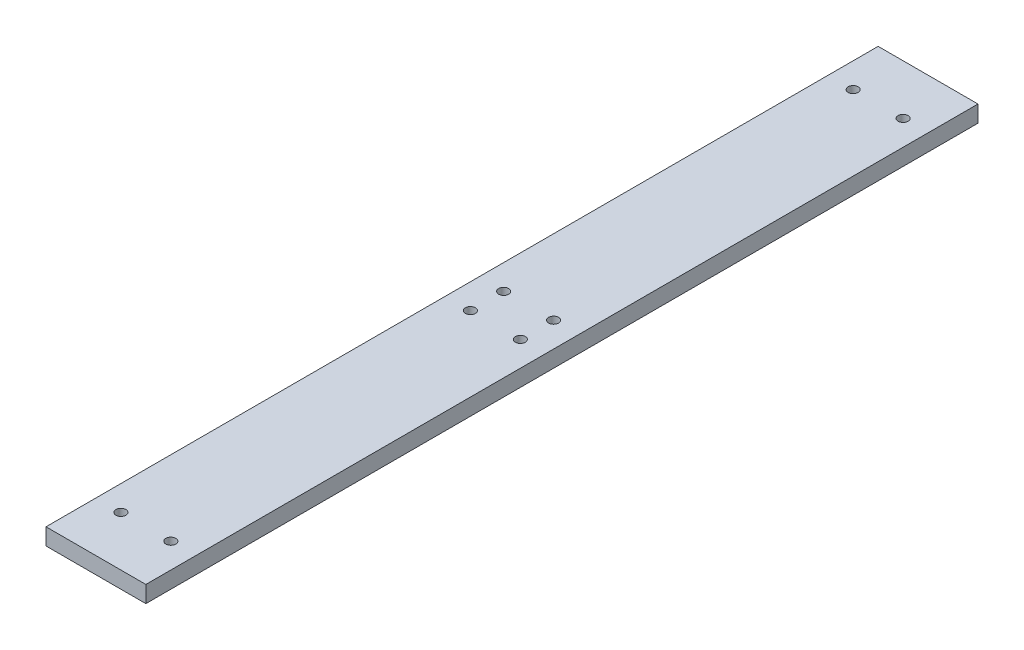
ISO-10303-21;
HEADER;
FILE_DESCRIPTION(('STEP AP214'),'2;1');
FILE_NAME('part.step','',(''),(''),'','','');
FILE_SCHEMA(('AUTOMOTIVE_DESIGN { 1 0 10303 214 1 1 1 1 }'));
ENDSEC;
DATA;
#1=APPLICATION_CONTEXT('core data for automotive mechanical design processes');
#2=APPLICATION_PROTOCOL_DEFINITION('international standard','automotive_design',2000,#1);
#3=PRODUCT_CONTEXT('',#1,'mechanical');
#4=PRODUCT('Part','Part','',(#3));
#5=PRODUCT_RELATED_PRODUCT_CATEGORY('part','',(#4));
#6=PRODUCT_DEFINITION_FORMATION('','',#4);
#7=PRODUCT_DEFINITION_CONTEXT('part definition',#1,'design');
#8=PRODUCT_DEFINITION('design','',#6,#7);
#9=PRODUCT_DEFINITION_SHAPE('','',#8);
#10=(LENGTH_UNIT() NAMED_UNIT(*) SI_UNIT(.MILLI.,.METRE.));
#11=(NAMED_UNIT(*) PLANE_ANGLE_UNIT() SI_UNIT($,.RADIAN.));
#12=(NAMED_UNIT(*) SI_UNIT($,.STERADIAN.) SOLID_ANGLE_UNIT());
#13=UNCERTAINTY_MEASURE_WITH_UNIT(LENGTH_MEASURE(1.E-05),#10,'distance_accuracy_value','');
#14=(GEOMETRIC_REPRESENTATION_CONTEXT(3) GLOBAL_UNCERTAINTY_ASSIGNED_CONTEXT((#13)) GLOBAL_UNIT_ASSIGNED_CONTEXT((#10,
#11,#12)) REPRESENTATION_CONTEXT('',''));
#15=CARTESIAN_POINT('',(0.,0.,0.));
#16=DIRECTION('',(0.,0.,1.));
#17=DIRECTION('',(1.,0.,0.));
#18=AXIS2_PLACEMENT_3D('',#15,#16,#17);
#19=CARTESIAN_POINT('',(0.,20.,0.));
#20=DIRECTION('',(0.,-1.,0.));
#21=DIRECTION('',(0.,0.,-1.));
#22=AXIS2_PLACEMENT_3D('',#19,#20,#21);
#23=PLANE('',#22);
#24=DIRECTION('',(0.,0.,1.));
#25=VECTOR('',#24,1.);
#26=CARTESIAN_POINT('',(0.,20.,0.));
#27=LINE('',#26,#25);
#28=CARTESIAN_POINT('',(0.,20.,-1000.));
#29=VERTEX_POINT('',#28);
#30=CARTESIAN_POINT('',(0.,20.,0.));
#31=VERTEX_POINT('',#30);
#32=EDGE_CURVE('E86',#29,#31,#27,.T.);
#33=ORIENTED_EDGE('',*,*,#32,.T.);
#34=DIRECTION('',(1.,0.,0.));
#35=VECTOR('',#34,1.);
#36=CARTESIAN_POINT('',(0.,20.,0.));
#37=LINE('',#36,#35);
#38=CARTESIAN_POINT('',(120.,20.,0.));
#39=VERTEX_POINT('',#38);
#40=EDGE_CURVE('E81',#31,#39,#37,.T.);
#41=ORIENTED_EDGE('',*,*,#40,.T.);
#42=DIRECTION('',(0.,0.,-1.));
#43=VECTOR('',#42,1.);
#44=CARTESIAN_POINT('',(120.,20.,0.));
#45=LINE('',#44,#43);
#46=CARTESIAN_POINT('',(120.,20.,-1000.));
#47=VERTEX_POINT('',#46);
#48=EDGE_CURVE('E84',#39,#47,#45,.T.);
#49=ORIENTED_EDGE('',*,*,#48,.T.);
#50=DIRECTION('',(-1.,0.,0.));
#51=VECTOR('',#50,1.);
#52=CARTESIAN_POINT('',(0.,20.,-1000.));
#53=LINE('',#52,#51);
#54=EDGE_CURVE('E51',#47,#29,#53,.T.);
#55=ORIENTED_EDGE('',*,*,#54,.T.);
#56=EDGE_LOOP('',(#33,#41,#49,#55));
#57=FACE_BOUND('',#56,.T.);
#58=CARTESIAN_POINT('',(30.,20.,-60.));
#59=DIRECTION('',(0.,1.,0.));
#60=DIRECTION('',(0.,0.,1.));
#61=AXIS2_PLACEMENT_3D('',#58,#59,#60);
#62=CIRCLE('',#61,5.99999999999999);
#63=CARTESIAN_POINT('',(30.,20.,-54.));
#64=VERTEX_POINT('',#63);
#65=EDGE_CURVE('E101',#64,#64,#62,.T.);
#66=ORIENTED_EDGE('',*,*,#65,.F.);
#67=EDGE_LOOP('',(#66));
#68=FACE_BOUND('',#67,.T.);
#69=CARTESIAN_POINT('',(90.,20.,-60.));
#70=DIRECTION('',(0.,1.,0.));
#71=DIRECTION('',(0.,0.,-1.));
#72=AXIS2_PLACEMENT_3D('',#69,#70,#71);
#73=CIRCLE('',#72,5.99999999999999);
#74=CARTESIAN_POINT('',(90.,20.,-66.));
#75=VERTEX_POINT('',#74);
#76=EDGE_CURVE('E116',#75,#75,#73,.T.);
#77=ORIENTED_EDGE('',*,*,#76,.F.);
#78=EDGE_LOOP('',(#77));
#79=FACE_BOUND('',#78,.T.);
#80=CARTESIAN_POINT('',(90.,20.,-480.));
#81=DIRECTION('',(0.,1.,0.));
#82=DIRECTION('',(0.,0.,1.));
#83=AXIS2_PLACEMENT_3D('',#80,#81,#82);
#84=CIRCLE('',#83,5.99999999999999);
#85=CARTESIAN_POINT('',(90.,20.,-474.));
#86=VERTEX_POINT('',#85);
#87=EDGE_CURVE('E122',#86,#86,#84,.T.);
#88=ORIENTED_EDGE('',*,*,#87,.F.);
#89=EDGE_LOOP('',(#88));
#90=FACE_BOUND('',#89,.T.);
#91=CARTESIAN_POINT('',(30.,20.,-480.));
#92=DIRECTION('',(0.,1.,0.));
#93=DIRECTION('',(0.,0.,-1.));
#94=AXIS2_PLACEMENT_3D('',#91,#92,#93);
#95=CIRCLE('',#94,6.00000000000001);
#96=CARTESIAN_POINT('',(30.,20.,-486.));
#97=VERTEX_POINT('',#96);
#98=EDGE_CURVE('E128',#97,#97,#95,.T.);
#99=ORIENTED_EDGE('',*,*,#98,.F.);
#100=EDGE_LOOP('',(#99));
#101=FACE_BOUND('',#100,.T.);
#102=CARTESIAN_POINT('',(90.,20.,-520.));
#103=DIRECTION('',(0.,1.,0.));
#104=DIRECTION('',(0.,0.,-1.));
#105=AXIS2_PLACEMENT_3D('',#102,#103,#104);
#106=CIRCLE('',#105,5.99999999999999);
#107=CARTESIAN_POINT('',(90.,20.,-526.));
#108=VERTEX_POINT('',#107);
#109=EDGE_CURVE('E134',#108,#108,#106,.T.);
#110=ORIENTED_EDGE('',*,*,#109,.F.);
#111=EDGE_LOOP('',(#110));
#112=FACE_BOUND('',#111,.T.);
#113=CARTESIAN_POINT('',(90.,20.,-940.));
#114=DIRECTION('',(0.,1.,0.));
#115=DIRECTION('',(0.,0.,1.));
#116=AXIS2_PLACEMENT_3D('',#113,#114,#115);
#117=CIRCLE('',#116,5.99999999999999);
#118=CARTESIAN_POINT('',(90.,20.,-934.));
#119=VERTEX_POINT('',#118);
#120=EDGE_CURVE('E140',#119,#119,#117,.T.);
#121=ORIENTED_EDGE('',*,*,#120,.F.);
#122=EDGE_LOOP('',(#121));
#123=FACE_BOUND('',#122,.T.);
#124=CARTESIAN_POINT('',(30.,20.,-940.));
#125=DIRECTION('',(0.,1.,0.));
#126=DIRECTION('',(0.,0.,-1.));
#127=AXIS2_PLACEMENT_3D('',#124,#125,#126);
#128=CIRCLE('',#127,6.);
#129=CARTESIAN_POINT('',(30.,20.,-946.));
#130=VERTEX_POINT('',#129);
#131=EDGE_CURVE('E146',#130,#130,#128,.T.);
#132=ORIENTED_EDGE('',*,*,#131,.F.);
#133=EDGE_LOOP('',(#132));
#134=FACE_BOUND('',#133,.T.);
#135=CARTESIAN_POINT('',(30.,20.,-520.));
#136=DIRECTION('',(0.,1.,0.));
#137=DIRECTION('',(0.,0.,1.));
#138=AXIS2_PLACEMENT_3D('',#135,#136,#137);
#139=CIRCLE('',#138,6.00000000000001);
#140=CARTESIAN_POINT('',(30.,20.,-514.));
#141=VERTEX_POINT('',#140);
#142=EDGE_CURVE('E152',#141,#141,#139,.T.);
#143=ORIENTED_EDGE('',*,*,#142,.F.);
#144=EDGE_LOOP('',(#143));
#145=FACE_BOUND('',#144,.T.);
#146=ADVANCED_FACE('F34',(#57,#68,#79,#90,#101,#112,#123,#134,#145),#23,.F.);
#147=CARTESIAN_POINT('',(0.,0.,0.));
#148=DIRECTION('',(0.,-1.,0.));
#149=DIRECTION('',(0.,0.,-1.));
#150=AXIS2_PLACEMENT_3D('',#147,#148,#149);
#151=PLANE('',#150);
#152=CARTESIAN_POINT('',(30.,0.,-940.));
#153=DIRECTION('',(0.,1.,0.));
#154=DIRECTION('',(0.,0.,-1.));
#155=AXIS2_PLACEMENT_3D('',#152,#153,#154);
#156=CIRCLE('',#155,6.);
#157=CARTESIAN_POINT('',(30.,0.,-946.));
#158=VERTEX_POINT('',#157);
#159=EDGE_CURVE('E149',#158,#158,#156,.T.);
#160=ORIENTED_EDGE('',*,*,#159,.T.);
#161=EDGE_LOOP('',(#160));
#162=FACE_BOUND('',#161,.T.);
#163=CARTESIAN_POINT('',(90.,0.,-520.));
#164=DIRECTION('',(0.,1.,0.));
#165=DIRECTION('',(0.,0.,-1.));
#166=AXIS2_PLACEMENT_3D('',#163,#164,#165);
#167=CIRCLE('',#166,5.99999999999999);
#168=CARTESIAN_POINT('',(90.,0.,-526.));
#169=VERTEX_POINT('',#168);
#170=EDGE_CURVE('E137',#169,#169,#167,.T.);
#171=ORIENTED_EDGE('',*,*,#170,.T.);
#172=EDGE_LOOP('',(#171));
#173=FACE_BOUND('',#172,.T.);
#174=CARTESIAN_POINT('',(90.,0.,-480.));
#175=DIRECTION('',(0.,1.,0.));
#176=DIRECTION('',(0.,0.,1.));
#177=AXIS2_PLACEMENT_3D('',#174,#175,#176);
#178=CIRCLE('',#177,5.99999999999999);
#179=CARTESIAN_POINT('',(90.,0.,-474.));
#180=VERTEX_POINT('',#179);
#181=EDGE_CURVE('E125',#180,#180,#178,.T.);
#182=ORIENTED_EDGE('',*,*,#181,.T.);
#183=EDGE_LOOP('',(#182));
#184=FACE_BOUND('',#183,.T.);
#185=CARTESIAN_POINT('',(30.,0.,-60.));
#186=DIRECTION('',(0.,1.,0.));
#187=DIRECTION('',(0.,0.,1.));
#188=AXIS2_PLACEMENT_3D('',#185,#186,#187);
#189=CIRCLE('',#188,5.99999999999999);
#190=CARTESIAN_POINT('',(30.,0.,-54.));
#191=VERTEX_POINT('',#190);
#192=EDGE_CURVE('E113',#191,#191,#189,.T.);
#193=ORIENTED_EDGE('',*,*,#192,.T.);
#194=EDGE_LOOP('',(#193));
#195=FACE_BOUND('',#194,.T.);
#196=DIRECTION('',(0.,0.,1.));
#197=VECTOR('',#196,1.);
#198=CARTESIAN_POINT('',(0.,0.,0.));
#199=LINE('',#198,#197);
#200=CARTESIAN_POINT('',(0.,0.,-1000.));
#201=VERTEX_POINT('',#200);
#202=CARTESIAN_POINT('',(0.,0.,0.));
#203=VERTEX_POINT('',#202);
#204=EDGE_CURVE('E98',#201,#203,#199,.T.);
#205=ORIENTED_EDGE('',*,*,#204,.F.);
#206=DIRECTION('',(-1.,0.,0.));
#207=VECTOR('',#206,1.);
#208=CARTESIAN_POINT('',(0.,0.,-1000.));
#209=LINE('',#208,#207);
#210=CARTESIAN_POINT('',(120.,0.,-1000.));
#211=VERTEX_POINT('',#210);
#212=EDGE_CURVE('E74',#211,#201,#209,.T.);
#213=ORIENTED_EDGE('',*,*,#212,.F.);
#214=DIRECTION('',(0.,0.,-1.));
#215=VECTOR('',#214,1.);
#216=CARTESIAN_POINT('',(120.,0.,0.));
#217=LINE('',#216,#215);
#218=CARTESIAN_POINT('',(120.,0.,0.));
#219=VERTEX_POINT('',#218);
#220=EDGE_CURVE('E68',#219,#211,#217,.T.);
#221=ORIENTED_EDGE('',*,*,#220,.F.);
#222=DIRECTION('',(1.,0.,0.));
#223=VECTOR('',#222,1.);
#224=CARTESIAN_POINT('',(0.,0.,0.));
#225=LINE('',#224,#223);
#226=EDGE_CURVE('E90',#203,#219,#225,.T.);
#227=ORIENTED_EDGE('',*,*,#226,.F.);
#228=EDGE_LOOP('',(#205,#213,#221,#227));
#229=FACE_BOUND('',#228,.T.);
#230=CARTESIAN_POINT('',(90.,0.,-60.));
#231=DIRECTION('',(0.,1.,0.));
#232=DIRECTION('',(0.,0.,-1.));
#233=AXIS2_PLACEMENT_3D('',#230,#231,#232);
#234=CIRCLE('',#233,5.99999999999999);
#235=CARTESIAN_POINT('',(90.,0.,-66.));
#236=VERTEX_POINT('',#235);
#237=EDGE_CURVE('E119',#236,#236,#234,.T.);
#238=ORIENTED_EDGE('',*,*,#237,.T.);
#239=EDGE_LOOP('',(#238));
#240=FACE_BOUND('',#239,.T.);
#241=CARTESIAN_POINT('',(30.,0.,-480.));
#242=DIRECTION('',(0.,1.,0.));
#243=DIRECTION('',(0.,0.,-1.));
#244=AXIS2_PLACEMENT_3D('',#241,#242,#243);
#245=CIRCLE('',#244,6.00000000000001);
#246=CARTESIAN_POINT('',(30.,0.,-486.));
#247=VERTEX_POINT('',#246);
#248=EDGE_CURVE('E131',#247,#247,#245,.T.);
#249=ORIENTED_EDGE('',*,*,#248,.T.);
#250=EDGE_LOOP('',(#249));
#251=FACE_BOUND('',#250,.T.);
#252=CARTESIAN_POINT('',(90.,0.,-940.));
#253=DIRECTION('',(0.,1.,0.));
#254=DIRECTION('',(0.,0.,1.));
#255=AXIS2_PLACEMENT_3D('',#252,#253,#254);
#256=CIRCLE('',#255,5.99999999999999);
#257=CARTESIAN_POINT('',(90.,0.,-934.));
#258=VERTEX_POINT('',#257);
#259=EDGE_CURVE('E143',#258,#258,#256,.T.);
#260=ORIENTED_EDGE('',*,*,#259,.T.);
#261=EDGE_LOOP('',(#260));
#262=FACE_BOUND('',#261,.T.);
#263=CARTESIAN_POINT('',(30.,0.,-520.));
#264=DIRECTION('',(0.,1.,0.));
#265=DIRECTION('',(0.,0.,1.));
#266=AXIS2_PLACEMENT_3D('',#263,#264,#265);
#267=CIRCLE('',#266,6.00000000000001);
#268=CARTESIAN_POINT('',(30.,0.,-514.));
#269=VERTEX_POINT('',#268);
#270=EDGE_CURVE('E155',#269,#269,#267,.T.);
#271=ORIENTED_EDGE('',*,*,#270,.T.);
#272=EDGE_LOOP('',(#271));
#273=FACE_BOUND('',#272,.T.);
#274=ADVANCED_FACE('F109',(#162,#173,#184,#195,#229,#240,#251,#262,#273),#151,.T.);
#275=CARTESIAN_POINT('',(0.,20.,0.));
#276=DIRECTION('',(1.,0.,0.));
#277=DIRECTION('',(0.,0.,-1.));
#278=AXIS2_PLACEMENT_3D('',#275,#276,#277);
#279=PLANE('',#278);
#280=ORIENTED_EDGE('',*,*,#204,.T.);
#281=DIRECTION('',(0.,-1.,0.));
#282=VECTOR('',#281,1.);
#283=CARTESIAN_POINT('',(0.,20.,0.));
#284=LINE('',#283,#282);
#285=EDGE_CURVE('E11',#31,#203,#284,.T.);
#286=ORIENTED_EDGE('',*,*,#285,.F.);
#287=ORIENTED_EDGE('',*,*,#32,.F.);
#288=DIRECTION('',(0.,-1.,0.));
#289=VECTOR('',#288,1.);
#290=CARTESIAN_POINT('',(0.,20.,-1000.));
#291=LINE('',#290,#289);
#292=EDGE_CURVE('E94',#29,#201,#291,.T.);
#293=ORIENTED_EDGE('',*,*,#292,.T.);
#294=EDGE_LOOP('',(#280,#286,#287,#293));
#295=FACE_BOUND('',#294,.T.);
#296=ADVANCED_FACE('F36',(#295),#279,.F.);
#297=CARTESIAN_POINT('',(0.,20.,0.));
#298=DIRECTION('',(0.,0.,-1.));
#299=DIRECTION('',(-1.,0.,0.));
#300=AXIS2_PLACEMENT_3D('',#297,#298,#299);
#301=PLANE('',#300);
#302=ORIENTED_EDGE('',*,*,#226,.T.);
#303=DIRECTION('',(0.,-1.,0.));
#304=VECTOR('',#303,1.);
#305=CARTESIAN_POINT('',(120.,20.,0.));
#306=LINE('',#305,#304);
#307=EDGE_CURVE('E43',#39,#219,#306,.T.);
#308=ORIENTED_EDGE('',*,*,#307,.F.);
#309=ORIENTED_EDGE('',*,*,#40,.F.);
#310=ORIENTED_EDGE('',*,*,#285,.T.);
#311=EDGE_LOOP('',(#302,#308,#309,#310));
#312=FACE_BOUND('',#311,.T.);
#313=ADVANCED_FACE('F89',(#312),#301,.F.);
#314=CARTESIAN_POINT('',(120.,20.,0.));
#315=DIRECTION('',(-1.,0.,0.));
#316=DIRECTION('',(0.,0.,1.));
#317=AXIS2_PLACEMENT_3D('',#314,#315,#316);
#318=PLANE('',#317);
#319=ORIENTED_EDGE('',*,*,#220,.T.);
#320=DIRECTION('',(0.,-1.,0.));
#321=VECTOR('',#320,1.);
#322=CARTESIAN_POINT('',(120.,20.,-1000.));
#323=LINE('',#322,#321);
#324=EDGE_CURVE('E91',#47,#211,#323,.T.);
#325=ORIENTED_EDGE('',*,*,#324,.F.);
#326=ORIENTED_EDGE('',*,*,#48,.F.);
#327=ORIENTED_EDGE('',*,*,#307,.T.);
#328=EDGE_LOOP('',(#319,#325,#326,#327));
#329=FACE_BOUND('',#328,.T.);
#330=ADVANCED_FACE('F92',(#329),#318,.F.);
#331=CARTESIAN_POINT('',(0.,20.,-1000.));
#332=DIRECTION('',(0.,0.,1.));
#333=DIRECTION('',(1.,0.,0.));
#334=AXIS2_PLACEMENT_3D('',#331,#332,#333);
#335=PLANE('',#334);
#336=ORIENTED_EDGE('',*,*,#212,.T.);
#337=ORIENTED_EDGE('',*,*,#292,.F.);
#338=ORIENTED_EDGE('',*,*,#54,.F.);
#339=ORIENTED_EDGE('',*,*,#324,.T.);
#340=EDGE_LOOP('',(#336,#337,#338,#339));
#341=FACE_BOUND('',#340,.T.);
#342=ADVANCED_FACE('F106',(#341),#335,.F.);
#343=CARTESIAN_POINT('',(30.,20.,-60.));
#344=DIRECTION('',(0.,-1.,0.));
#345=DIRECTION('',(0.,0.,-1.));
#346=AXIS2_PLACEMENT_3D('',#343,#344,#345);
#347=CYLINDRICAL_SURFACE('',#346,5.99999999999999);
#348=ORIENTED_EDGE('',*,*,#65,.T.);
#349=EDGE_LOOP('',(#348));
#350=FACE_BOUND('',#349,.T.);
#351=ORIENTED_EDGE('',*,*,#192,.F.);
#352=EDGE_LOOP('',(#351));
#353=FACE_BOUND('',#352,.T.);
#354=ADVANCED_FACE('F172',(#350,#353),#347,.F.);
#355=CARTESIAN_POINT('',(90.,20.,-60.));
#356=DIRECTION('',(0.,-1.,0.));
#357=DIRECTION('',(0.,0.,-1.));
#358=AXIS2_PLACEMENT_3D('',#355,#356,#357);
#359=CYLINDRICAL_SURFACE('',#358,5.99999999999999);
#360=ORIENTED_EDGE('',*,*,#76,.T.);
#361=EDGE_LOOP('',(#360));
#362=FACE_BOUND('',#361,.T.);
#363=ORIENTED_EDGE('',*,*,#237,.F.);
#364=EDGE_LOOP('',(#363));
#365=FACE_BOUND('',#364,.T.);
#366=ADVANCED_FACE('F218',(#362,#365),#359,.F.);
#367=CARTESIAN_POINT('',(90.,20.,-480.));
#368=DIRECTION('',(0.,-1.,0.));
#369=DIRECTION('',(0.,0.,-1.));
#370=AXIS2_PLACEMENT_3D('',#367,#368,#369);
#371=CYLINDRICAL_SURFACE('',#370,5.99999999999999);
#372=ORIENTED_EDGE('',*,*,#87,.T.);
#373=EDGE_LOOP('',(#372));
#374=FACE_BOUND('',#373,.T.);
#375=ORIENTED_EDGE('',*,*,#181,.F.);
#376=EDGE_LOOP('',(#375));
#377=FACE_BOUND('',#376,.T.);
#378=ADVANCED_FACE('F226',(#374,#377),#371,.F.);
#379=CARTESIAN_POINT('',(30.,20.,-480.));
#380=DIRECTION('',(0.,-1.,0.));
#381=DIRECTION('',(0.,0.,-1.));
#382=AXIS2_PLACEMENT_3D('',#379,#380,#381);
#383=CYLINDRICAL_SURFACE('',#382,6.00000000000001);
#384=ORIENTED_EDGE('',*,*,#98,.T.);
#385=EDGE_LOOP('',(#384));
#386=FACE_BOUND('',#385,.T.);
#387=ORIENTED_EDGE('',*,*,#248,.F.);
#388=EDGE_LOOP('',(#387));
#389=FACE_BOUND('',#388,.T.);
#390=ADVANCED_FACE('F234',(#386,#389),#383,.F.);
#391=CARTESIAN_POINT('',(90.,20.,-520.));
#392=DIRECTION('',(0.,-1.,0.));
#393=DIRECTION('',(0.,0.,-1.));
#394=AXIS2_PLACEMENT_3D('',#391,#392,#393);
#395=CYLINDRICAL_SURFACE('',#394,5.99999999999999);
#396=ORIENTED_EDGE('',*,*,#109,.T.);
#397=EDGE_LOOP('',(#396));
#398=FACE_BOUND('',#397,.T.);
#399=ORIENTED_EDGE('',*,*,#170,.F.);
#400=EDGE_LOOP('',(#399));
#401=FACE_BOUND('',#400,.T.);
#402=ADVANCED_FACE('F243',(#398,#401),#395,.F.);
#403=CARTESIAN_POINT('',(90.,20.,-940.));
#404=DIRECTION('',(0.,-1.,0.));
#405=DIRECTION('',(0.,0.,-1.));
#406=AXIS2_PLACEMENT_3D('',#403,#404,#405);
#407=CYLINDRICAL_SURFACE('',#406,5.99999999999999);
#408=ORIENTED_EDGE('',*,*,#120,.T.);
#409=EDGE_LOOP('',(#408));
#410=FACE_BOUND('',#409,.T.);
#411=ORIENTED_EDGE('',*,*,#259,.F.);
#412=EDGE_LOOP('',(#411));
#413=FACE_BOUND('',#412,.T.);
#414=ADVANCED_FACE('F252',(#410,#413),#407,.F.);
#415=CARTESIAN_POINT('',(30.,20.,-940.));
#416=DIRECTION('',(0.,-1.,0.));
#417=DIRECTION('',(0.,0.,-1.));
#418=AXIS2_PLACEMENT_3D('',#415,#416,#417);
#419=CYLINDRICAL_SURFACE('',#418,6.);
#420=ORIENTED_EDGE('',*,*,#131,.T.);
#421=EDGE_LOOP('',(#420));
#422=FACE_BOUND('',#421,.T.);
#423=ORIENTED_EDGE('',*,*,#159,.F.);
#424=EDGE_LOOP('',(#423));
#425=FACE_BOUND('',#424,.T.);
#426=ADVANCED_FACE('F261',(#422,#425),#419,.F.);
#427=CARTESIAN_POINT('',(30.,20.,-520.));
#428=DIRECTION('',(0.,-1.,0.));
#429=DIRECTION('',(0.,0.,-1.));
#430=AXIS2_PLACEMENT_3D('',#427,#428,#429);
#431=CYLINDRICAL_SURFACE('',#430,6.00000000000001);
#432=ORIENTED_EDGE('',*,*,#142,.T.);
#433=EDGE_LOOP('',(#432));
#434=FACE_BOUND('',#433,.T.);
#435=ORIENTED_EDGE('',*,*,#270,.F.);
#436=EDGE_LOOP('',(#435));
#437=FACE_BOUND('',#436,.T.);
#438=ADVANCED_FACE('F161',(#434,#437),#431,.F.);
#439=CLOSED_SHELL('',(#146,#274,#296,#313,#330,#342,#354,#366,#378,#390,#402,#414,#426,#438));
#440=MANIFOLD_SOLID_BREP('B2',#439);
#441=ADVANCED_BREP_SHAPE_REPRESENTATION('',(#18,#440),#14);
#442=SHAPE_DEFINITION_REPRESENTATION(#9,#441);
ENDSEC;
END-ISO-10303-21;
